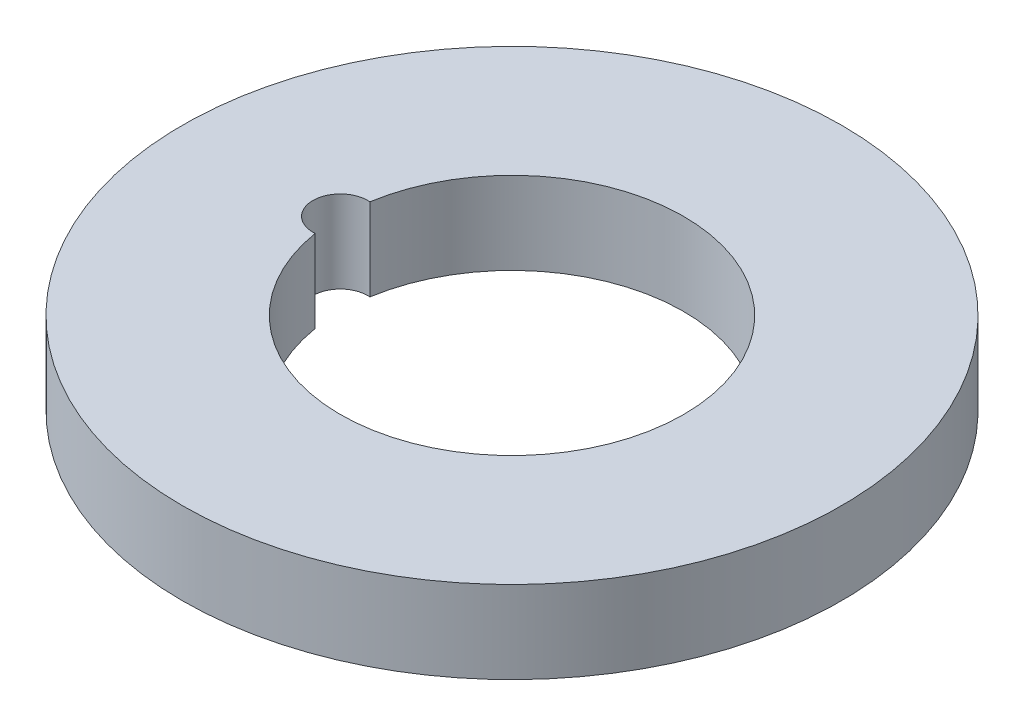
ISO-10303-21;
HEADER;
FILE_DESCRIPTION(('STEP AP214'),'2;1');
FILE_NAME('part.step','',(''),(''),'','','');
FILE_SCHEMA(('AUTOMOTIVE_DESIGN { 1 0 10303 214 1 1 1 1 }'));
ENDSEC;
DATA;
#1=APPLICATION_CONTEXT('core data for automotive mechanical design processes');
#2=APPLICATION_PROTOCOL_DEFINITION('international standard','automotive_design',2000,#1);
#3=PRODUCT_CONTEXT('',#1,'mechanical');
#4=PRODUCT('Part','Part','',(#3));
#5=PRODUCT_RELATED_PRODUCT_CATEGORY('part','',(#4));
#6=PRODUCT_DEFINITION_FORMATION('','',#4);
#7=PRODUCT_DEFINITION_CONTEXT('part definition',#1,'design');
#8=PRODUCT_DEFINITION('design','',#6,#7);
#9=PRODUCT_DEFINITION_SHAPE('','',#8);
#10=(LENGTH_UNIT() NAMED_UNIT(*) SI_UNIT(.MILLI.,.METRE.));
#11=(NAMED_UNIT(*) PLANE_ANGLE_UNIT() SI_UNIT($,.RADIAN.));
#12=(NAMED_UNIT(*) SI_UNIT($,.STERADIAN.) SOLID_ANGLE_UNIT());
#13=UNCERTAINTY_MEASURE_WITH_UNIT(LENGTH_MEASURE(1.E-05),#10,'distance_accuracy_value','');
#14=(GEOMETRIC_REPRESENTATION_CONTEXT(3) GLOBAL_UNCERTAINTY_ASSIGNED_CONTEXT((#13)) GLOBAL_UNIT_ASSIGNED_CONTEXT((#10,
#11,#12)) REPRESENTATION_CONTEXT('',''));
#15=CARTESIAN_POINT('',(0.,0.,0.));
#16=DIRECTION('',(0.,0.,1.));
#17=DIRECTION('',(1.,0.,0.));
#18=AXIS2_PLACEMENT_3D('',#15,#16,#17);
#19=CARTESIAN_POINT('',(0.,3.,0.));
#20=DIRECTION('',(0.,1.,0.));
#21=DIRECTION('',(0.,0.,1.));
#22=AXIS2_PLACEMENT_3D('',#19,#20,#21);
#23=PLANE('',#22);
#24=CARTESIAN_POINT('',(0.,3.,0.));
#25=DIRECTION('',(0.,1.,0.));
#26=DIRECTION('',(0.,0.,1.));
#27=AXIS2_PLACEMENT_3D('',#24,#25,#26);
#28=CIRCLE('',#27,12.);
#29=CARTESIAN_POINT('',(0.,3.,12.));
#30=VERTEX_POINT('',#29);
#31=EDGE_CURVE('E11',#30,#30,#28,.T.);
#32=ORIENTED_EDGE('',*,*,#31,.T.);
#33=EDGE_LOOP('',(#32));
#34=FACE_BOUND('',#33,.T.);
#35=CARTESIAN_POINT('',(0.,3.,0.));
#36=DIRECTION('',(0.,1.,0.));
#37=DIRECTION('',(0.,0.,1.));
#38=AXIS2_PLACEMENT_3D('',#35,#36,#37);
#39=CIRCLE('',#38,6.25);
#40=CARTESIAN_POINT('',(-6.17,3.,0.996794863550172));
#41=VERTEX_POINT('',#40);
#42=CARTESIAN_POINT('',(-6.17,3.,-0.996794863550179));
#43=VERTEX_POINT('',#42);
#44=EDGE_CURVE('E74',#41,#43,#39,.T.);
#45=ORIENTED_EDGE('',*,*,#44,.F.);
#46=CARTESIAN_POINT('',(-6.25,3.,0.));
#47=DIRECTION('',(0.,1.,0.));
#48=DIRECTION('',(0.,0.,1.));
#49=AXIS2_PLACEMENT_3D('',#46,#47,#48);
#50=CIRCLE('',#49,1.);
#51=EDGE_CURVE('E65',#43,#41,#50,.T.);
#52=ORIENTED_EDGE('',*,*,#51,.F.);
#53=EDGE_LOOP('',(#45,#52));
#54=FACE_BOUND('',#53,.T.);
#55=ADVANCED_FACE('F33',(#34,#54),#23,.T.);
#56=CARTESIAN_POINT('',(0.,0.,0.));
#57=DIRECTION('',(0.,1.,0.));
#58=DIRECTION('',(0.,0.,1.));
#59=AXIS2_PLACEMENT_3D('',#56,#57,#58);
#60=PLANE('',#59);
#61=CARTESIAN_POINT('',(0.,0.,0.));
#62=DIRECTION('',(0.,1.,0.));
#63=DIRECTION('',(0.,0.,1.));
#64=AXIS2_PLACEMENT_3D('',#61,#62,#63);
#65=CIRCLE('',#64,12.);
#66=CARTESIAN_POINT('',(0.,0.,12.));
#67=VERTEX_POINT('',#66);
#68=EDGE_CURVE('E37',#67,#67,#65,.T.);
#69=ORIENTED_EDGE('',*,*,#68,.F.);
#70=EDGE_LOOP('',(#69));
#71=FACE_BOUND('',#70,.T.);
#72=CARTESIAN_POINT('',(-6.25,0.,0.));
#73=DIRECTION('',(0.,1.,0.));
#74=DIRECTION('',(0.,0.,1.));
#75=AXIS2_PLACEMENT_3D('',#72,#73,#74);
#76=CIRCLE('',#75,1.);
#77=CARTESIAN_POINT('',(-6.17,0.,-0.996794863550179));
#78=VERTEX_POINT('',#77);
#79=CARTESIAN_POINT('',(-6.17,0.,0.996794863550172));
#80=VERTEX_POINT('',#79);
#81=EDGE_CURVE('E55',#78,#80,#76,.T.);
#82=ORIENTED_EDGE('',*,*,#81,.T.);
#83=CARTESIAN_POINT('',(0.,0.,0.));
#84=DIRECTION('',(0.,1.,0.));
#85=DIRECTION('',(0.,0.,1.));
#86=AXIS2_PLACEMENT_3D('',#83,#84,#85);
#87=CIRCLE('',#86,6.25);
#88=EDGE_CURVE('E61',#80,#78,#87,.T.);
#89=ORIENTED_EDGE('',*,*,#88,.T.);
#90=EDGE_LOOP('',(#82,#89));
#91=FACE_BOUND('',#90,.T.);
#92=ADVANCED_FACE('F71',(#71,#91),#60,.F.);
#93=CARTESIAN_POINT('',(0.,3.,0.));
#94=DIRECTION('',(0.,-1.,0.));
#95=DIRECTION('',(0.,0.,-1.));
#96=AXIS2_PLACEMENT_3D('',#93,#94,#95);
#97=CYLINDRICAL_SURFACE('',#96,12.);
#98=ORIENTED_EDGE('',*,*,#31,.F.);
#99=EDGE_LOOP('',(#98));
#100=FACE_BOUND('',#99,.T.);
#101=ORIENTED_EDGE('',*,*,#68,.T.);
#102=EDGE_LOOP('',(#101));
#103=FACE_BOUND('',#102,.T.);
#104=ADVANCED_FACE('F35',(#100,#103),#97,.T.);
#105=CARTESIAN_POINT('',(-6.25,3.,0.));
#106=DIRECTION('',(0.,-1.,0.));
#107=DIRECTION('',(0.,0.,-1.));
#108=AXIS2_PLACEMENT_3D('',#105,#106,#107);
#109=CYLINDRICAL_SURFACE('',#108,1.);
#110=ORIENTED_EDGE('',*,*,#81,.F.);
#111=DIRECTION('',(0.,-1.,0.));
#112=VECTOR('',#111,1.);
#113=CARTESIAN_POINT('',(-6.17,3.,-0.996794863550179));
#114=LINE('',#113,#112);
#115=EDGE_CURVE('E63',#43,#78,#114,.T.);
#116=ORIENTED_EDGE('',*,*,#115,.F.);
#117=ORIENTED_EDGE('',*,*,#51,.T.);
#118=DIRECTION('',(0.,-1.,0.));
#119=VECTOR('',#118,1.);
#120=CARTESIAN_POINT('',(-6.17,3.,0.996794863550172));
#121=LINE('',#120,#119);
#122=EDGE_CURVE('E48',#41,#80,#121,.T.);
#123=ORIENTED_EDGE('',*,*,#122,.T.);
#124=EDGE_LOOP('',(#110,#116,#117,#123));
#125=FACE_BOUND('',#124,.T.);
#126=ADVANCED_FACE('F67',(#125),#109,.F.);
#127=CARTESIAN_POINT('',(0.,3.,0.));
#128=DIRECTION('',(0.,-1.,0.));
#129=DIRECTION('',(0.,0.,-1.));
#130=AXIS2_PLACEMENT_3D('',#127,#128,#129);
#131=CYLINDRICAL_SURFACE('',#130,6.25);
#132=ORIENTED_EDGE('',*,*,#88,.F.);
#133=ORIENTED_EDGE('',*,*,#122,.F.);
#134=ORIENTED_EDGE('',*,*,#44,.T.);
#135=ORIENTED_EDGE('',*,*,#115,.T.);
#136=EDGE_LOOP('',(#132,#133,#134,#135));
#137=FACE_BOUND('',#136,.T.);
#138=ADVANCED_FACE('F62',(#137),#131,.F.);
#139=CLOSED_SHELL('',(#55,#92,#104,#126,#138));
#140=MANIFOLD_SOLID_BREP('B2',#139);
#141=ADVANCED_BREP_SHAPE_REPRESENTATION('',(#18,#140),#14);
#142=SHAPE_DEFINITION_REPRESENTATION(#9,#141);
ENDSEC;
END-ISO-10303-21;
